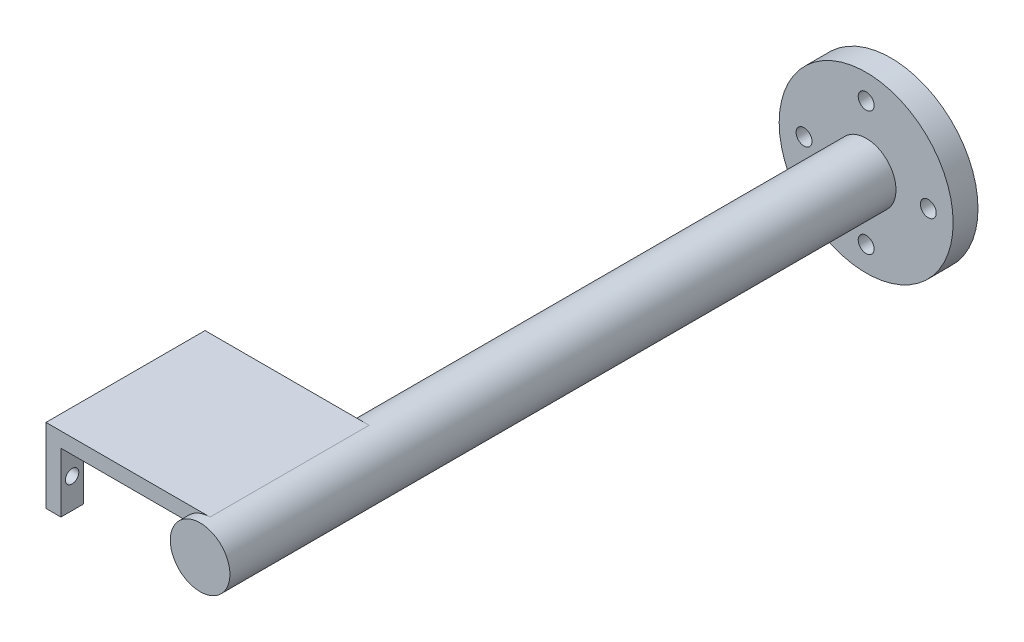
ISO-10303-21;
HEADER;
FILE_DESCRIPTION(('STEP AP214'),'2;1');
FILE_NAME('part.step','',(''),(''),'','','');
FILE_SCHEMA(('AUTOMOTIVE_DESIGN { 1 0 10303 214 1 1 1 1 }'));
ENDSEC;
DATA;
#1=APPLICATION_CONTEXT('core data for automotive mechanical design processes');
#2=APPLICATION_PROTOCOL_DEFINITION('international standard','automotive_design',2000,#1);
#3=PRODUCT_CONTEXT('',#1,'mechanical');
#4=PRODUCT('Part','Part','',(#3));
#5=PRODUCT_RELATED_PRODUCT_CATEGORY('part','',(#4));
#6=PRODUCT_DEFINITION_FORMATION('','',#4);
#7=PRODUCT_DEFINITION_CONTEXT('part definition',#1,'design');
#8=PRODUCT_DEFINITION('design','',#6,#7);
#9=PRODUCT_DEFINITION_SHAPE('','',#8);
#10=(LENGTH_UNIT() NAMED_UNIT(*) SI_UNIT(.MILLI.,.METRE.));
#11=(NAMED_UNIT(*) PLANE_ANGLE_UNIT() SI_UNIT($,.RADIAN.));
#12=(NAMED_UNIT(*) SI_UNIT($,.STERADIAN.) SOLID_ANGLE_UNIT());
#13=UNCERTAINTY_MEASURE_WITH_UNIT(LENGTH_MEASURE(1.E-05),#10,'distance_accuracy_value','');
#14=(GEOMETRIC_REPRESENTATION_CONTEXT(3) GLOBAL_UNCERTAINTY_ASSIGNED_CONTEXT((#13)) GLOBAL_UNIT_ASSIGNED_CONTEXT((#10,
#11,#12)) REPRESENTATION_CONTEXT('',''));
#15=CARTESIAN_POINT('',(0.,0.,0.));
#16=DIRECTION('',(0.,0.,1.));
#17=DIRECTION('',(1.,0.,0.));
#18=AXIS2_PLACEMENT_3D('',#15,#16,#17);
#19=CARTESIAN_POINT('',(0.594228071569445,2.67363740881257,0.));
#20=DIRECTION('',(0.,0.,1.));
#21=DIRECTION('',(1.,0.,0.));
#22=AXIS2_PLACEMENT_3D('',#19,#20,#21);
#23=PLANE('',#22);
#24=CARTESIAN_POINT('',(0.594228071569445,2.67363740881257,0.));
#25=DIRECTION('',(0.,0.,-1.));
#26=DIRECTION('',(-1.,0.,0.));
#27=AXIS2_PLACEMENT_3D('',#24,#25,#26);
#28=CIRCLE('',#27,6.);
#29=CARTESIAN_POINT('',(-4.60192435113719,5.67363740881257,0.));
#30=VERTEX_POINT('',#29);
#31=CARTESIAN_POINT('',(0.594228071569445,8.67363740881257,0.));
#32=VERTEX_POINT('',#31);
#33=EDGE_CURVE('E215',#30,#32,#28,.T.);
#34=ORIENTED_EDGE('',*,*,#33,.F.);
#35=DIRECTION('',(1.,0.,0.));
#36=VECTOR('',#35,1.);
#37=CARTESIAN_POINT('',(-4.60192435113719,5.67363740881257,0.));
#38=LINE('',#37,#36);
#39=CARTESIAN_POINT('',(-29.4057719284306,5.67363740881257,0.));
#40=VERTEX_POINT('',#39);
#41=EDGE_CURVE('E156',#40,#30,#38,.T.);
#42=ORIENTED_EDGE('',*,*,#41,.F.);
#43=DIRECTION('',(0.,1.,0.));
#44=VECTOR('',#43,1.);
#45=CARTESIAN_POINT('',(-29.4057719284306,5.67363740881257,0.));
#46=LINE('',#45,#44);
#47=CARTESIAN_POINT('',(-29.4057719284306,-6.32636259118743,0.));
#48=VERTEX_POINT('',#47);
#49=EDGE_CURVE('E153',#48,#40,#46,.T.);
#50=ORIENTED_EDGE('',*,*,#49,.F.);
#51=DIRECTION('',(1.,0.,0.));
#52=VECTOR('',#51,1.);
#53=CARTESIAN_POINT('',(-32.4057719284306,-6.32636259118743,0.));
#54=LINE('',#53,#52);
#55=CARTESIAN_POINT('',(-32.4057719284306,-6.32636259118743,0.));
#56=VERTEX_POINT('',#55);
#57=EDGE_CURVE('E166',#56,#48,#54,.T.);
#58=ORIENTED_EDGE('',*,*,#57,.F.);
#59=DIRECTION('',(0.,-1.,0.));
#60=VECTOR('',#59,1.);
#61=CARTESIAN_POINT('',(-32.4057719284306,5.67363740881257,0.));
#62=LINE('',#61,#60);
#63=CARTESIAN_POINT('',(-32.4057719284306,8.67363740881257,0.));
#64=VERTEX_POINT('',#63);
#65=EDGE_CURVE('E163',#64,#56,#62,.T.);
#66=ORIENTED_EDGE('',*,*,#65,.F.);
#67=DIRECTION('',(-1.,0.,0.));
#68=VECTOR('',#67,1.);
#69=CARTESIAN_POINT('',(-32.4057719284306,8.67363740881257,0.));
#70=LINE('',#69,#68);
#71=EDGE_CURVE('E136',#32,#64,#70,.T.);
#72=ORIENTED_EDGE('',*,*,#71,.F.);
#73=EDGE_LOOP('',(#34,#42,#50,#58,#66,#72));
#74=FACE_BOUND('',#73,.T.);
#75=ADVANCED_FACE('F48',(#74),#23,.F.);
#76=CARTESIAN_POINT('',(-29.4057719284306,5.67363740881257,32.));
#77=DIRECTION('',(-1.,0.,0.));
#78=DIRECTION('',(0.,0.,1.));
#79=AXIS2_PLACEMENT_3D('',#76,#77,#78);
#80=PLANE('',#79);
#81=CARTESIAN_POINT('',(-29.4057719284306,-0.326362591187431,29.75));
#82=DIRECTION('',(-1.,0.,0.));
#83=DIRECTION('',(0.,0.,1.));
#84=AXIS2_PLACEMENT_3D('',#81,#82,#83);
#85=CIRCLE('',#84,1.35);
#86=CARTESIAN_POINT('',(-29.4057719284306,-0.326362591187431,31.1));
#87=VERTEX_POINT('',#86);
#88=EDGE_CURVE('E264',#87,#87,#85,.T.);
#89=ORIENTED_EDGE('',*,*,#88,.T.);
#90=EDGE_LOOP('',(#89));
#91=FACE_BOUND('',#90,.T.);
#92=DIRECTION('',(0.,-1.,0.));
#93=VECTOR('',#92,1.);
#94=CARTESIAN_POINT('',(-29.4057719284306,5.67363740881257,27.5));
#95=LINE('',#94,#93);
#96=CARTESIAN_POINT('',(-29.4057719284306,5.67363740881257,27.5));
#97=VERTEX_POINT('',#96);
#98=CARTESIAN_POINT('',(-29.4057719284306,-6.32636259118743,27.5));
#99=VERTEX_POINT('',#98);
#100=EDGE_CURVE('E67',#97,#99,#95,.T.);
#101=ORIENTED_EDGE('',*,*,#100,.F.);
#102=DIRECTION('',(0.,0.,-1.));
#103=VECTOR('',#102,1.);
#104=CARTESIAN_POINT('',(-29.4057719284306,5.67363740881257,32.));
#105=LINE('',#104,#103);
#106=CARTESIAN_POINT('',(-29.4057719284306,5.67363740881257,32.));
#107=VERTEX_POINT('',#106);
#108=EDGE_CURVE('E184',#107,#97,#105,.T.);
#109=ORIENTED_EDGE('',*,*,#108,.F.);
#110=DIRECTION('',(0.,1.,0.));
#111=VECTOR('',#110,1.);
#112=CARTESIAN_POINT('',(-29.4057719284306,5.67363740881257,32.));
#113=LINE('',#112,#111);
#114=CARTESIAN_POINT('',(-29.4057719284306,-6.32636259118743,32.));
#115=VERTEX_POINT('',#114);
#116=EDGE_CURVE('E169',#115,#107,#113,.T.);
#117=ORIENTED_EDGE('',*,*,#116,.F.);
#118=DIRECTION('',(0.,0.,-1.));
#119=VECTOR('',#118,1.);
#120=CARTESIAN_POINT('',(-29.4057719284306,-6.32636259118743,32.));
#121=LINE('',#120,#119);
#122=EDGE_CURVE('E170',#115,#99,#121,.T.);
#123=ORIENTED_EDGE('',*,*,#122,.T.);
#124=EDGE_LOOP('',(#101,#109,#117,#123));
#125=FACE_BOUND('',#124,.T.);
#126=ADVANCED_FACE('F323',(#91,#125),#80,.F.);
#127=CARTESIAN_POINT('',(-32.4057719284306,-6.32636259118743,32.));
#128=DIRECTION('',(0.,1.,0.));
#129=DIRECTION('',(0.,0.,1.));
#130=AXIS2_PLACEMENT_3D('',#127,#128,#129);
#131=PLANE('',#130);
#132=DIRECTION('',(-1.,0.,0.));
#133=VECTOR('',#132,1.);
#134=CARTESIAN_POINT('',(-32.4057719284306,-6.32636259118743,27.5));
#135=LINE('',#134,#133);
#136=CARTESIAN_POINT('',(-32.4057719284306,-6.32636259118744,27.5));
#137=VERTEX_POINT('',#136);
#138=EDGE_CURVE('E59',#99,#137,#135,.T.);
#139=ORIENTED_EDGE('',*,*,#138,.F.);
#140=ORIENTED_EDGE('',*,*,#122,.F.);
#141=DIRECTION('',(1.,0.,0.));
#142=VECTOR('',#141,1.);
#143=CARTESIAN_POINT('',(-32.4057719284306,-6.32636259118743,32.));
#144=LINE('',#143,#142);
#145=CARTESIAN_POINT('',(-32.4057719284306,-6.32636259118743,32.));
#146=VERTEX_POINT('',#145);
#147=EDGE_CURVE('E76',#146,#115,#144,.T.);
#148=ORIENTED_EDGE('',*,*,#147,.F.);
#149=DIRECTION('',(0.,0.,-1.));
#150=VECTOR('',#149,1.);
#151=CARTESIAN_POINT('',(-32.4057719284306,-6.32636259118743,32.));
#152=LINE('',#151,#150);
#153=EDGE_CURVE('E141',#146,#137,#152,.T.);
#154=ORIENTED_EDGE('',*,*,#153,.T.);
#155=EDGE_LOOP('',(#139,#140,#148,#154));
#156=FACE_BOUND('',#155,.T.);
#157=ADVANCED_FACE('F321',(#156),#131,.F.);
#158=CARTESIAN_POINT('',(0.594228071569445,2.67363740881257,32.));
#159=DIRECTION('',(0.,0.,1.));
#160=DIRECTION('',(1.,0.,0.));
#161=AXIS2_PLACEMENT_3D('',#158,#159,#160);
#162=PLANE('',#161);
#163=CARTESIAN_POINT('',(0.594228071569445,2.67363740881257,32.));
#164=DIRECTION('',(0.,0.,1.));
#165=DIRECTION('',(1.,0.,0.));
#166=AXIS2_PLACEMENT_3D('',#163,#164,#165);
#167=CIRCLE('',#166,6.);
#168=CARTESIAN_POINT('',(0.594228071569445,8.67363740881257,32.));
#169=VERTEX_POINT('',#168);
#170=CARTESIAN_POINT('',(-4.60192435113719,5.67363740881257,32.));
#171=VERTEX_POINT('',#170);
#172=EDGE_CURVE('E125',#169,#171,#167,.T.);
#173=ORIENTED_EDGE('',*,*,#172,.F.);
#174=DIRECTION('',(-1.,0.,0.));
#175=VECTOR('',#174,1.);
#176=CARTESIAN_POINT('',(-5.40577192843056,8.67363740881257,32.));
#177=LINE('',#176,#175);
#178=CARTESIAN_POINT('',(-32.4057719284306,8.67363740881257,32.));
#179=VERTEX_POINT('',#178);
#180=EDGE_CURVE('E117',#169,#179,#177,.T.);
#181=ORIENTED_EDGE('',*,*,#180,.T.);
#182=DIRECTION('',(0.,-1.,0.));
#183=VECTOR('',#182,1.);
#184=CARTESIAN_POINT('',(-32.4057719284306,5.67363740881257,32.));
#185=LINE('',#184,#183);
#186=EDGE_CURVE('E121',#179,#146,#185,.T.);
#187=ORIENTED_EDGE('',*,*,#186,.T.);
#188=ORIENTED_EDGE('',*,*,#147,.T.);
#189=ORIENTED_EDGE('',*,*,#116,.T.);
#190=DIRECTION('',(1.,0.,0.));
#191=VECTOR('',#190,1.);
#192=CARTESIAN_POINT('',(-4.60192435113719,5.67363740881257,32.));
#193=LINE('',#192,#191);
#194=EDGE_CURVE('E110',#107,#171,#193,.T.);
#195=ORIENTED_EDGE('',*,*,#194,.T.);
#196=EDGE_LOOP('',(#173,#181,#187,#188,#189,#195));
#197=FACE_BOUND('',#196,.T.);
#198=ADVANCED_FACE('F119',(#197),#162,.T.);
#199=CARTESIAN_POINT('',(-29.4057719284306,-0.326362591187435,2.25));
#200=DIRECTION('',(-1.,0.,0.));
#201=DIRECTION('',(0.,0.,1.));
#202=AXIS2_PLACEMENT_3D('',#199,#200,#201);
#203=CIRCLE('',#202,1.35);
#204=CARTESIAN_POINT('',(-29.4057719284306,-0.326362591187435,3.6));
#205=VERTEX_POINT('',#204);
#206=EDGE_CURVE('E268',#205,#205,#203,.T.);
#207=ORIENTED_EDGE('',*,*,#206,.T.);
#208=EDGE_LOOP('',(#207));
#209=FACE_BOUND('',#208,.T.);
#210=CARTESIAN_POINT('',(-29.4057719284306,5.67363740881257,4.50000000000001));
#211=VERTEX_POINT('',#210);
#212=EDGE_CURVE('E183',#211,#40,#105,.T.);
#213=ORIENTED_EDGE('',*,*,#212,.F.);
#214=DIRECTION('',(0.,-1.,0.));
#215=VECTOR('',#214,1.);
#216=CARTESIAN_POINT('',(-29.4057719284306,5.67363740881256,4.50000000000001));
#217=LINE('',#216,#215);
#218=CARTESIAN_POINT('',(-29.4057719284306,-6.32636259118744,4.50000000000001));
#219=VERTEX_POINT('',#218);
#220=EDGE_CURVE('E261',#211,#219,#217,.T.);
#221=ORIENTED_EDGE('',*,*,#220,.T.);
#222=EDGE_CURVE('E101',#219,#48,#121,.T.);
#223=ORIENTED_EDGE('',*,*,#222,.T.);
#224=ORIENTED_EDGE('',*,*,#49,.T.);
#225=EDGE_LOOP('',(#213,#221,#223,#224));
#226=FACE_BOUND('',#225,.T.);
#227=ADVANCED_FACE('F50',(#209,#226),#80,.F.);
#228=CARTESIAN_POINT('',(-4.60192435113719,5.67363740881257,32.));
#229=DIRECTION('',(0.,1.,0.));
#230=DIRECTION('',(-1.,0.,0.));
#231=AXIS2_PLACEMENT_3D('',#228,#229,#230);
#232=PLANE('',#231);
#233=ORIENTED_EDGE('',*,*,#108,.T.);
#234=DIRECTION('',(-1.,0.,0.));
#235=VECTOR('',#234,1.);
#236=CARTESIAN_POINT('',(-27.4057719284306,5.67363740881257,27.5));
#237=LINE('',#236,#235);
#238=CARTESIAN_POINT('',(-32.4057719284306,5.67363740881257,27.5));
#239=VERTEX_POINT('',#238);
#240=EDGE_CURVE('E251',#97,#239,#237,.T.);
#241=ORIENTED_EDGE('',*,*,#240,.T.);
#242=DIRECTION('',(0.,0.,-1.));
#243=VECTOR('',#242,1.);
#244=CARTESIAN_POINT('',(-32.4057719284306,5.67363740881257,27.5));
#245=LINE('',#244,#243);
#246=CARTESIAN_POINT('',(-32.4057719284306,5.67363740881257,4.50000000000001));
#247=VERTEX_POINT('',#246);
#248=EDGE_CURVE('E247',#239,#247,#245,.T.);
#249=ORIENTED_EDGE('',*,*,#248,.T.);
#250=DIRECTION('',(-1.,0.,0.));
#251=VECTOR('',#250,1.);
#252=CARTESIAN_POINT('',(-27.4057719284306,5.67363740881257,4.50000000000001));
#253=LINE('',#252,#251);
#254=EDGE_CURVE('E252',#211,#247,#253,.T.);
#255=ORIENTED_EDGE('',*,*,#254,.F.);
#256=ORIENTED_EDGE('',*,*,#212,.T.);
#257=ORIENTED_EDGE('',*,*,#41,.T.);
#258=DIRECTION('',(0.,0.,-1.));
#259=VECTOR('',#258,1.);
#260=CARTESIAN_POINT('',(-4.60192435113719,5.67363740881257,32.));
#261=LINE('',#260,#259);
#262=EDGE_CURVE('E179',#171,#30,#261,.T.);
#263=ORIENTED_EDGE('',*,*,#262,.F.);
#264=ORIENTED_EDGE('',*,*,#194,.F.);
#265=EDGE_LOOP('',(#233,#241,#249,#255,#256,#257,#263,#264));
#266=FACE_BOUND('',#265,.T.);
#267=ADVANCED_FACE('F282',(#266),#232,.F.);
#268=CARTESIAN_POINT('',(0.594228071569445,2.67363740881257,32.));
#269=DIRECTION('',(0.,0.,-1.));
#270=DIRECTION('',(-1.,0.,0.));
#271=AXIS2_PLACEMENT_3D('',#268,#269,#270);
#272=CYLINDRICAL_SURFACE('',#271,6.);
#273=ORIENTED_EDGE('',*,*,#262,.T.);
#274=ORIENTED_EDGE('',*,*,#33,.T.);
#275=DIRECTION('',(0.,0.,-1.));
#276=VECTOR('',#275,1.);
#277=CARTESIAN_POINT('',(0.594228071569445,8.67363740881257,32.));
#278=LINE('',#277,#276);
#279=EDGE_CURVE('E140',#169,#32,#278,.T.);
#280=ORIENTED_EDGE('',*,*,#279,.F.);
#281=ORIENTED_EDGE('',*,*,#172,.T.);
#282=EDGE_LOOP('',(#273,#274,#280,#281));
#283=FACE_BOUND('',#282,.T.);
#284=CARTESIAN_POINT('',(0.594228071569445,2.67363740881257,34.));
#285=DIRECTION('',(0.,0.,1.));
#286=DIRECTION('',(1.,0.,0.));
#287=AXIS2_PLACEMENT_3D('',#284,#285,#286);
#288=CIRCLE('',#287,6.);
#289=CARTESIAN_POINT('',(6.59422807156945,2.67363740881257,34.));
#290=VERTEX_POINT('',#289);
#291=EDGE_CURVE('E225',#290,#290,#288,.T.);
#292=ORIENTED_EDGE('',*,*,#291,.F.);
#293=EDGE_LOOP('',(#292));
#294=FACE_BOUND('',#293,.T.);
#295=CARTESIAN_POINT('',(0.594228071569445,2.67363740881257,-100.));
#296=DIRECTION('',(0.,0.,-1.));
#297=DIRECTION('',(-1.,0.,0.));
#298=AXIS2_PLACEMENT_3D('',#295,#296,#297);
#299=CIRCLE('',#298,6.);
#300=CARTESIAN_POINT('',(-5.40577192843056,2.67363740881257,-100.));
#301=VERTEX_POINT('',#300);
#302=EDGE_CURVE('E219',#301,#301,#299,.T.);
#303=ORIENTED_EDGE('',*,*,#302,.F.);
#304=EDGE_LOOP('',(#303));
#305=FACE_BOUND('',#304,.T.);
#306=ADVANCED_FACE('F286',(#283,#294,#305),#272,.T.);
#307=CARTESIAN_POINT('',(-32.4057719284306,8.67363740881257,32.));
#308=DIRECTION('',(0.,-1.,0.));
#309=DIRECTION('',(0.,0.,-1.));
#310=AXIS2_PLACEMENT_3D('',#307,#308,#309);
#311=PLANE('',#310);
#312=ORIENTED_EDGE('',*,*,#71,.T.);
#313=DIRECTION('',(0.,0.,-1.));
#314=VECTOR('',#313,1.);
#315=CARTESIAN_POINT('',(-32.4057719284306,8.67363740881257,32.));
#316=LINE('',#315,#314);
#317=EDGE_CURVE('E133',#179,#64,#316,.T.);
#318=ORIENTED_EDGE('',*,*,#317,.F.);
#319=ORIENTED_EDGE('',*,*,#180,.F.);
#320=ORIENTED_EDGE('',*,*,#279,.T.);
#321=EDGE_LOOP('',(#312,#318,#319,#320));
#322=FACE_BOUND('',#321,.T.);
#323=ADVANCED_FACE('F134',(#322),#311,.F.);
#324=CARTESIAN_POINT('',(-32.4057719284306,5.67363740881257,32.));
#325=DIRECTION('',(1.,0.,0.));
#326=DIRECTION('',(0.,0.,-1.));
#327=AXIS2_PLACEMENT_3D('',#324,#325,#326);
#328=PLANE('',#327);
#329=CARTESIAN_POINT('',(-32.4057719284306,-0.326362591187435,2.25));
#330=DIRECTION('',(-1.,0.,0.));
#331=DIRECTION('',(0.,0.,1.));
#332=AXIS2_PLACEMENT_3D('',#329,#330,#331);
#333=CIRCLE('',#332,1.35);
#334=CARTESIAN_POINT('',(-32.4057719284306,-0.326362591187435,3.6));
#335=VERTEX_POINT('',#334);
#336=EDGE_CURVE('E237',#335,#335,#333,.T.);
#337=ORIENTED_EDGE('',*,*,#336,.F.);
#338=EDGE_LOOP('',(#337));
#339=FACE_BOUND('',#338,.T.);
#340=CARTESIAN_POINT('',(-32.4057719284306,-0.326362591187431,29.75));
#341=DIRECTION('',(-1.,0.,0.));
#342=DIRECTION('',(0.,0.,1.));
#343=AXIS2_PLACEMENT_3D('',#340,#341,#342);
#344=CIRCLE('',#343,1.35);
#345=CARTESIAN_POINT('',(-32.4057719284306,-0.326362591187431,31.1));
#346=VERTEX_POINT('',#345);
#347=EDGE_CURVE('E232',#346,#346,#344,.T.);
#348=ORIENTED_EDGE('',*,*,#347,.F.);
#349=EDGE_LOOP('',(#348));
#350=FACE_BOUND('',#349,.T.);
#351=CARTESIAN_POINT('',(-32.4057719284306,-6.32636259118744,4.50000000000001));
#352=VERTEX_POINT('',#351);
#353=EDGE_CURVE('E174',#352,#56,#152,.T.);
#354=ORIENTED_EDGE('',*,*,#353,.F.);
#355=DIRECTION('',(0.,-1.,0.));
#356=VECTOR('',#355,1.);
#357=CARTESIAN_POINT('',(-32.4057719284306,5.67363740881257,4.50000000000001));
#358=LINE('',#357,#356);
#359=EDGE_CURVE('E236',#247,#352,#358,.T.);
#360=ORIENTED_EDGE('',*,*,#359,.F.);
#361=ORIENTED_EDGE('',*,*,#248,.F.);
#362=DIRECTION('',(0.,-1.,0.));
#363=VECTOR('',#362,1.);
#364=CARTESIAN_POINT('',(-32.4057719284306,5.67363740881257,27.5));
#365=LINE('',#364,#363);
#366=EDGE_CURVE('E244',#239,#137,#365,.T.);
#367=ORIENTED_EDGE('',*,*,#366,.T.);
#368=ORIENTED_EDGE('',*,*,#153,.F.);
#369=ORIENTED_EDGE('',*,*,#186,.F.);
#370=ORIENTED_EDGE('',*,*,#317,.T.);
#371=ORIENTED_EDGE('',*,*,#65,.T.);
#372=EDGE_LOOP('',(#354,#360,#361,#367,#368,#369,#370,#371));
#373=FACE_BOUND('',#372,.T.);
#374=ADVANCED_FACE('F144',(#339,#350,#373),#328,.F.);
#375=ORIENTED_EDGE('',*,*,#222,.F.);
#376=DIRECTION('',(-1.,0.,0.));
#377=VECTOR('',#376,1.);
#378=CARTESIAN_POINT('',(-32.4057719284306,-6.32636259118743,4.50000000000001));
#379=LINE('',#378,#377);
#380=EDGE_CURVE('E11',#219,#352,#379,.T.);
#381=ORIENTED_EDGE('',*,*,#380,.T.);
#382=ORIENTED_EDGE('',*,*,#353,.T.);
#383=ORIENTED_EDGE('',*,*,#57,.T.);
#384=EDGE_LOOP('',(#375,#381,#382,#383));
#385=FACE_BOUND('',#384,.T.);
#386=ADVANCED_FACE('F310',(#385),#131,.F.);
#387=CARTESIAN_POINT('',(-27.4057719284306,5.67363740881257,4.50000000000001));
#388=DIRECTION('',(0.,0.,-1.));
#389=DIRECTION('',(0.,1.,0.));
#390=AXIS2_PLACEMENT_3D('',#387,#388,#389);
#391=PLANE('',#390);
#392=ORIENTED_EDGE('',*,*,#254,.T.);
#393=ORIENTED_EDGE('',*,*,#359,.T.);
#394=ORIENTED_EDGE('',*,*,#380,.F.);
#395=ORIENTED_EDGE('',*,*,#220,.F.);
#396=EDGE_LOOP('',(#392,#393,#394,#395));
#397=FACE_BOUND('',#396,.T.);
#398=ADVANCED_FACE('F306',(#397),#391,.F.);
#399=CARTESIAN_POINT('',(-27.4057719284306,5.67363740881257,27.5));
#400=DIRECTION('',(0.,0.,-1.));
#401=DIRECTION('',(-1.,0.,0.));
#402=AXIS2_PLACEMENT_3D('',#399,#400,#401);
#403=PLANE('',#402);
#404=ORIENTED_EDGE('',*,*,#100,.T.);
#405=ORIENTED_EDGE('',*,*,#138,.T.);
#406=ORIENTED_EDGE('',*,*,#366,.F.);
#407=ORIENTED_EDGE('',*,*,#240,.F.);
#408=EDGE_LOOP('',(#404,#405,#406,#407));
#409=FACE_BOUND('',#408,.T.);
#410=ADVANCED_FACE('F319',(#409),#403,.T.);
#411=CARTESIAN_POINT('',(-27.4057719284306,-0.326362591187431,29.75));
#412=DIRECTION('',(-1.,0.,0.));
#413=DIRECTION('',(0.,0.,1.));
#414=AXIS2_PLACEMENT_3D('',#411,#412,#413);
#415=CYLINDRICAL_SURFACE('',#414,1.35);
#416=ORIENTED_EDGE('',*,*,#347,.T.);
#417=EDGE_LOOP('',(#416));
#418=FACE_BOUND('',#417,.T.);
#419=ORIENTED_EDGE('',*,*,#88,.F.);
#420=EDGE_LOOP('',(#419));
#421=FACE_BOUND('',#420,.T.);
#422=ADVANCED_FACE('F346',(#418,#421),#415,.F.);
#423=CARTESIAN_POINT('',(-27.4057719284306,-0.326362591187435,2.25));
#424=DIRECTION('',(-1.,0.,0.));
#425=DIRECTION('',(0.,0.,1.));
#426=AXIS2_PLACEMENT_3D('',#423,#424,#425);
#427=CYLINDRICAL_SURFACE('',#426,1.35);
#428=ORIENTED_EDGE('',*,*,#336,.T.);
#429=EDGE_LOOP('',(#428));
#430=FACE_BOUND('',#429,.T.);
#431=ORIENTED_EDGE('',*,*,#206,.F.);
#432=EDGE_LOOP('',(#431));
#433=FACE_BOUND('',#432,.T.);
#434=ADVANCED_FACE('F343',(#430,#433),#427,.F.);
#435=CARTESIAN_POINT('',(0.594228071569445,2.67363740881257,34.));
#436=DIRECTION('',(0.,0.,1.));
#437=DIRECTION('',(1.,0.,0.));
#438=AXIS2_PLACEMENT_3D('',#435,#436,#437);
#439=PLANE('',#438);
#440=ORIENTED_EDGE('',*,*,#291,.T.);
#441=EDGE_LOOP('',(#440));
#442=FACE_BOUND('',#441,.T.);
#443=ADVANCED_FACE('F345',(#442),#439,.T.);
#444=CARTESIAN_POINT('',(0.594228071569445,2.67363740881257,-105.));
#445=DIRECTION('',(0.,0.,1.));
#446=DIRECTION('',(1.,0.,0.));
#447=AXIS2_PLACEMENT_3D('',#444,#445,#446);
#448=CYLINDRICAL_SURFACE('',#447,17.5);
#449=CARTESIAN_POINT('',(0.594228071569445,2.67363740881257,-105.));
#450=DIRECTION('',(0.,0.,-1.));
#451=DIRECTION('',(-1.,0.,0.));
#452=AXIS2_PLACEMENT_3D('',#449,#450,#451);
#453=CIRCLE('',#452,17.5);
#454=CARTESIAN_POINT('',(-16.9057719284306,2.67363740881257,-105.));
#455=VERTEX_POINT('',#454);
#456=EDGE_CURVE('E209',#455,#455,#453,.T.);
#457=ORIENTED_EDGE('',*,*,#456,.F.);
#458=EDGE_LOOP('',(#457));
#459=FACE_BOUND('',#458,.T.);
#460=CARTESIAN_POINT('',(0.594228071569445,2.67363740881257,-100.));
#461=DIRECTION('',(0.,0.,-1.));
#462=DIRECTION('',(-1.,0.,0.));
#463=AXIS2_PLACEMENT_3D('',#460,#461,#462);
#464=CIRCLE('',#463,17.5);
#465=CARTESIAN_POINT('',(-16.9057719284306,2.67363740881257,-100.));
#466=VERTEX_POINT('',#465);
#467=EDGE_CURVE('E204',#466,#466,#464,.T.);
#468=ORIENTED_EDGE('',*,*,#467,.T.);
#469=EDGE_LOOP('',(#468));
#470=FACE_BOUND('',#469,.T.);
#471=ADVANCED_FACE('F353',(#459,#470),#448,.T.);
#472=CARTESIAN_POINT('',(0.594228071569445,2.67363740881257,-105.));
#473=DIRECTION('',(0.,0.,-1.));
#474=DIRECTION('',(-1.,0.,0.));
#475=AXIS2_PLACEMENT_3D('',#472,#473,#474);
#476=PLANE('',#475);
#477=CARTESIAN_POINT('',(-11.9057719284306,2.67363740881257,-105.));
#478=DIRECTION('',(0.,0.,-1.));
#479=DIRECTION('',(-1.,0.,0.));
#480=AXIS2_PLACEMENT_3D('',#477,#478,#479);
#481=CIRCLE('',#480,1.6);
#482=CARTESIAN_POINT('',(-13.5057719284306,2.67363740881257,-105.));
#483=VERTEX_POINT('',#482);
#484=EDGE_CURVE('E194',#483,#483,#481,.T.);
#485=ORIENTED_EDGE('',*,*,#484,.F.);
#486=EDGE_LOOP('',(#485));
#487=FACE_BOUND('',#486,.T.);
#488=CARTESIAN_POINT('',(0.594228071569445,15.1736374088126,-105.));
#489=DIRECTION('',(0.,0.,-1.));
#490=DIRECTION('',(-1.,0.,0.));
#491=AXIS2_PLACEMENT_3D('',#488,#489,#490);
#492=CIRCLE('',#491,1.6);
#493=CARTESIAN_POINT('',(-1.00577192843056,15.1736374088126,-105.));
#494=VERTEX_POINT('',#493);
#495=EDGE_CURVE('E573',#494,#494,#492,.T.);
#496=ORIENTED_EDGE('',*,*,#495,.F.);
#497=EDGE_LOOP('',(#496));
#498=FACE_BOUND('',#497,.T.);
#499=CARTESIAN_POINT('',(13.0942280715694,2.67363740881257,-105.));
#500=DIRECTION('',(0.,0.,-1.));
#501=DIRECTION('',(-1.,0.,0.));
#502=AXIS2_PLACEMENT_3D('',#499,#500,#501);
#503=CIRCLE('',#502,1.6);
#504=CARTESIAN_POINT('',(11.4942280715694,2.67363740881257,-105.));
#505=VERTEX_POINT('',#504);
#506=EDGE_CURVE('E577',#505,#505,#503,.T.);
#507=ORIENTED_EDGE('',*,*,#506,.F.);
#508=EDGE_LOOP('',(#507));
#509=FACE_BOUND('',#508,.T.);
#510=CARTESIAN_POINT('',(0.594228071569445,-9.82636259118743,-105.));
#511=DIRECTION('',(0.,0.,-1.));
#512=DIRECTION('',(-1.,0.,0.));
#513=AXIS2_PLACEMENT_3D('',#510,#511,#512);
#514=CIRCLE('',#513,1.6);
#515=CARTESIAN_POINT('',(-1.00577192843056,-9.82636259118743,-105.));
#516=VERTEX_POINT('',#515);
#517=EDGE_CURVE('E582',#516,#516,#514,.T.);
#518=ORIENTED_EDGE('',*,*,#517,.F.);
#519=EDGE_LOOP('',(#518));
#520=FACE_BOUND('',#519,.T.);
#521=ORIENTED_EDGE('',*,*,#456,.T.);
#522=EDGE_LOOP('',(#521));
#523=FACE_BOUND('',#522,.T.);
#524=ADVANCED_FACE('F402',(#487,#498,#509,#520,#523),#476,.T.);
#525=CARTESIAN_POINT('',(0.594228071569445,2.67363740881257,-100.));
#526=DIRECTION('',(0.,0.,-1.));
#527=DIRECTION('',(-1.,0.,0.));
#528=AXIS2_PLACEMENT_3D('',#525,#526,#527);
#529=PLANE('',#528);
#530=CARTESIAN_POINT('',(-11.9057719284306,2.67363740881257,-100.));
#531=DIRECTION('',(0.,0.,-1.));
#532=DIRECTION('',(-1.,0.,0.));
#533=AXIS2_PLACEMENT_3D('',#530,#531,#532);
#534=CIRCLE('',#533,1.6);
#535=CARTESIAN_POINT('',(-13.5057719284306,2.67363740881257,-100.));
#536=VERTEX_POINT('',#535);
#537=EDGE_CURVE('E52',#536,#536,#534,.T.);
#538=ORIENTED_EDGE('',*,*,#537,.T.);
#539=EDGE_LOOP('',(#538));
#540=FACE_BOUND('',#539,.T.);
#541=CARTESIAN_POINT('',(0.594228071569445,15.1736374088126,-100.));
#542=DIRECTION('',(0.,0.,-1.));
#543=DIRECTION('',(-1.,0.,0.));
#544=AXIS2_PLACEMENT_3D('',#541,#542,#543);
#545=CIRCLE('',#544,1.6);
#546=CARTESIAN_POINT('',(-1.00577192843056,15.1736374088126,-100.));
#547=VERTEX_POINT('',#546);
#548=EDGE_CURVE('E197',#547,#547,#545,.T.);
#549=ORIENTED_EDGE('',*,*,#548,.T.);
#550=EDGE_LOOP('',(#549));
#551=FACE_BOUND('',#550,.T.);
#552=CARTESIAN_POINT('',(13.0942280715694,2.67363740881257,-100.));
#553=DIRECTION('',(0.,0.,-1.));
#554=DIRECTION('',(-1.,0.,0.));
#555=AXIS2_PLACEMENT_3D('',#552,#553,#554);
#556=CIRCLE('',#555,1.6);
#557=CARTESIAN_POINT('',(11.4942280715694,2.67363740881257,-100.));
#558=VERTEX_POINT('',#557);
#559=EDGE_CURVE('E193',#558,#558,#556,.T.);
#560=ORIENTED_EDGE('',*,*,#559,.T.);
#561=EDGE_LOOP('',(#560));
#562=FACE_BOUND('',#561,.T.);
#563=CARTESIAN_POINT('',(0.594228071569445,-9.82636259118743,-100.));
#564=DIRECTION('',(0.,0.,-1.));
#565=DIRECTION('',(-1.,0.,0.));
#566=AXIS2_PLACEMENT_3D('',#563,#564,#565);
#567=CIRCLE('',#566,1.6);
#568=CARTESIAN_POINT('',(-1.00577192843056,-9.82636259118743,-100.));
#569=VERTEX_POINT('',#568);
#570=EDGE_CURVE('E189',#569,#569,#567,.T.);
#571=ORIENTED_EDGE('',*,*,#570,.T.);
#572=EDGE_LOOP('',(#571));
#573=FACE_BOUND('',#572,.T.);
#574=ORIENTED_EDGE('',*,*,#302,.T.);
#575=EDGE_LOOP('',(#574));
#576=FACE_BOUND('',#575,.T.);
#577=ORIENTED_EDGE('',*,*,#467,.F.);
#578=EDGE_LOOP('',(#577));
#579=FACE_BOUND('',#578,.T.);
#580=ADVANCED_FACE('F411',(#540,#551,#562,#573,#576,#579),#529,.F.);
#581=CARTESIAN_POINT('',(0.594228071569445,-9.82636259118743,34.));
#582=DIRECTION('',(0.,0.,-1.));
#583=DIRECTION('',(-1.,0.,0.));
#584=AXIS2_PLACEMENT_3D('',#581,#582,#583);
#585=CYLINDRICAL_SURFACE('',#584,1.6);
#586=ORIENTED_EDGE('',*,*,#517,.T.);
#587=EDGE_LOOP('',(#586));
#588=FACE_BOUND('',#587,.T.);
#589=ORIENTED_EDGE('',*,*,#570,.F.);
#590=EDGE_LOOP('',(#589));
#591=FACE_BOUND('',#590,.T.);
#592=ADVANCED_FACE('F420',(#588,#591),#585,.F.);
#593=CARTESIAN_POINT('',(13.0942280715694,2.67363740881257,34.));
#594=DIRECTION('',(0.,0.,-1.));
#595=DIRECTION('',(-1.,0.,0.));
#596=AXIS2_PLACEMENT_3D('',#593,#594,#595);
#597=CYLINDRICAL_SURFACE('',#596,1.6);
#598=ORIENTED_EDGE('',*,*,#506,.T.);
#599=EDGE_LOOP('',(#598));
#600=FACE_BOUND('',#599,.T.);
#601=ORIENTED_EDGE('',*,*,#559,.F.);
#602=EDGE_LOOP('',(#601));
#603=FACE_BOUND('',#602,.T.);
#604=ADVANCED_FACE('F428',(#600,#603),#597,.F.);
#605=CARTESIAN_POINT('',(0.594228071569445,15.1736374088126,34.));
#606=DIRECTION('',(0.,0.,-1.));
#607=DIRECTION('',(-1.,0.,0.));
#608=AXIS2_PLACEMENT_3D('',#605,#606,#607);
#609=CYLINDRICAL_SURFACE('',#608,1.6);
#610=ORIENTED_EDGE('',*,*,#495,.T.);
#611=EDGE_LOOP('',(#610));
#612=FACE_BOUND('',#611,.T.);
#613=ORIENTED_EDGE('',*,*,#548,.F.);
#614=EDGE_LOOP('',(#613));
#615=FACE_BOUND('',#614,.T.);
#616=ADVANCED_FACE('F437',(#612,#615),#609,.F.);
#617=CARTESIAN_POINT('',(-11.9057719284306,2.67363740881257,34.));
#618=DIRECTION('',(0.,0.,-1.));
#619=DIRECTION('',(-1.,0.,0.));
#620=AXIS2_PLACEMENT_3D('',#617,#618,#619);
#621=CYLINDRICAL_SURFACE('',#620,1.6);
#622=ORIENTED_EDGE('',*,*,#484,.T.);
#623=EDGE_LOOP('',(#622));
#624=FACE_BOUND('',#623,.T.);
#625=ORIENTED_EDGE('',*,*,#537,.F.);
#626=EDGE_LOOP('',(#625));
#627=FACE_BOUND('',#626,.T.);
#628=ADVANCED_FACE('F446',(#624,#627),#621,.F.);
#629=CLOSED_SHELL('',(#75,#126,#157,#198,#227,#267,#306,#323,#374,#386,#398,#410,#422,#434,#443,
#471,#524,#580,#592,#604,#616,#628));
#630=CARTESIAN_POINT('',(0.594228071569445,2.67363740881257,0.));
#631=DIRECTION('',(0.,0.,-1.));
#632=DIRECTION('',(-1.,0.,0.));
#633=AXIS2_PLACEMENT_3D('',#630,#631,#632);
#634=PLANE('',#633);
#635=CARTESIAN_POINT('',(0.594228071569445,2.67363740881257,0.));
#636=DIRECTION('',(0.,0.,1.));
#637=DIRECTION('',(1.,0.,0.));
#638=AXIS2_PLACEMENT_3D('',#635,#636,#637);
#639=CIRCLE('',#638,4.1);
#640=CARTESIAN_POINT('',(4.69422807156944,2.67363740881257,0.));
#641=VERTEX_POINT('',#640);
#642=EDGE_CURVE('E157',#641,#641,#639,.T.);
#643=ORIENTED_EDGE('',*,*,#642,.T.);
#644=EDGE_LOOP('',(#643));
#645=FACE_BOUND('',#644,.T.);
#646=ADVANCED_FACE('F391',(#645),#634,.F.);
#647=CARTESIAN_POINT('',(0.594228071569445,2.67363740881257,32.));
#648=DIRECTION('',(0.,0.,1.));
#649=DIRECTION('',(1.,0.,0.));
#650=AXIS2_PLACEMENT_3D('',#647,#648,#649);
#651=PLANE('',#650);
#652=CARTESIAN_POINT('',(0.594228071569445,2.67363740881257,32.));
#653=DIRECTION('',(0.,0.,1.));
#654=DIRECTION('',(1.,0.,0.));
#655=AXIS2_PLACEMENT_3D('',#652,#653,#654);
#656=CIRCLE('',#655,4.1);
#657=CARTESIAN_POINT('',(4.69422807156944,2.67363740881257,32.));
#658=VERTEX_POINT('',#657);
#659=EDGE_CURVE('E229',#658,#658,#656,.T.);
#660=ORIENTED_EDGE('',*,*,#659,.F.);
#661=EDGE_LOOP('',(#660));
#662=FACE_BOUND('',#661,.T.);
#663=ADVANCED_FACE('F365',(#662),#651,.F.);
#664=CARTESIAN_POINT('',(0.594228071569445,2.67363740881257,32.));
#665=DIRECTION('',(0.,0.,-1.));
#666=DIRECTION('',(-1.,0.,0.));
#667=AXIS2_PLACEMENT_3D('',#664,#665,#666);
#668=CYLINDRICAL_SURFACE('',#667,4.1);
#669=ORIENTED_EDGE('',*,*,#659,.T.);
#670=EDGE_LOOP('',(#669));
#671=FACE_BOUND('',#670,.T.);
#672=ORIENTED_EDGE('',*,*,#642,.F.);
#673=EDGE_LOOP('',(#672));
#674=FACE_BOUND('',#673,.T.);
#675=ADVANCED_FACE('F364',(#671,#674),#668,.F.);
#676=CLOSED_SHELL('',(#646,#663,#675));
#677=ORIENTED_CLOSED_SHELL('',*,#676,.T.);
#678=BREP_WITH_VOIDS('B2',#629,(#677));
#679=ADVANCED_BREP_SHAPE_REPRESENTATION('',(#18,#678),#14);
#680=SHAPE_DEFINITION_REPRESENTATION(#9,#679);
ENDSEC;
END-ISO-10303-21;
